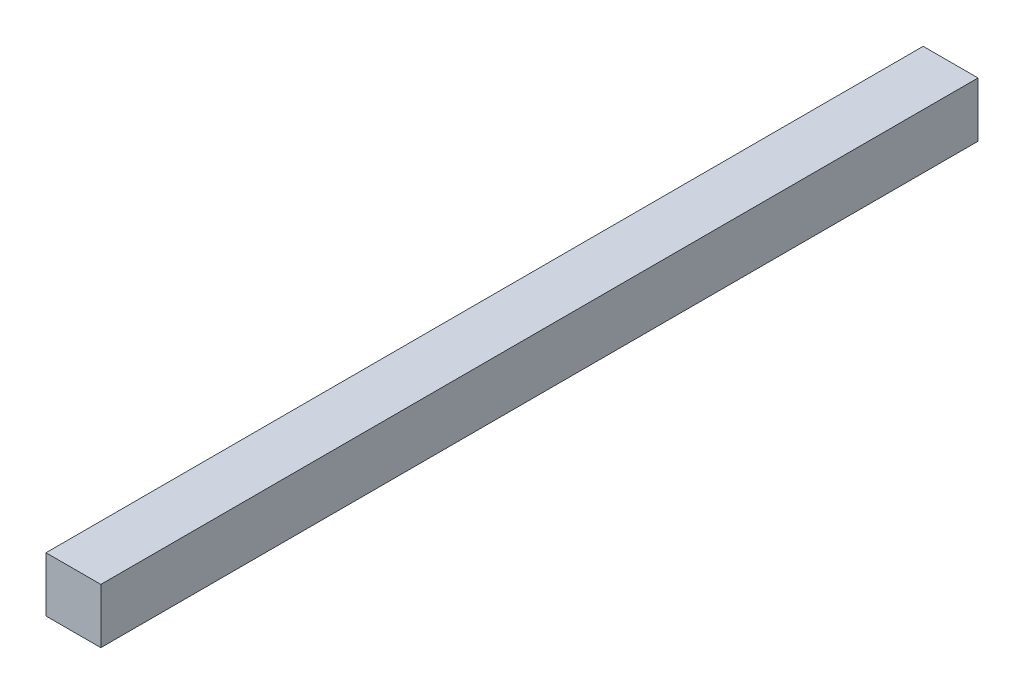
ISO-10303-21;
HEADER;
FILE_DESCRIPTION(('STEP AP214'),'2;1');
FILE_NAME('part.step','',(''),(''),'','','');
FILE_SCHEMA(('AUTOMOTIVE_DESIGN { 1 0 10303 214 1 1 1 1 }'));
ENDSEC;
DATA;
#1=APPLICATION_CONTEXT('core data for automotive mechanical design processes');
#2=APPLICATION_PROTOCOL_DEFINITION('international standard','automotive_design',2000,#1);
#3=PRODUCT_CONTEXT('',#1,'mechanical');
#4=PRODUCT('Part','Part','',(#3));
#5=PRODUCT_RELATED_PRODUCT_CATEGORY('part','',(#4));
#6=PRODUCT_DEFINITION_FORMATION('','',#4);
#7=PRODUCT_DEFINITION_CONTEXT('part definition',#1,'design');
#8=PRODUCT_DEFINITION('design','',#6,#7);
#9=PRODUCT_DEFINITION_SHAPE('','',#8);
#10=(LENGTH_UNIT() NAMED_UNIT(*) SI_UNIT(.MILLI.,.METRE.));
#11=(NAMED_UNIT(*) PLANE_ANGLE_UNIT() SI_UNIT($,.RADIAN.));
#12=(NAMED_UNIT(*) SI_UNIT($,.STERADIAN.) SOLID_ANGLE_UNIT());
#13=UNCERTAINTY_MEASURE_WITH_UNIT(LENGTH_MEASURE(1.E-05),#10,'distance_accuracy_value','');
#14=(GEOMETRIC_REPRESENTATION_CONTEXT(3) GLOBAL_UNCERTAINTY_ASSIGNED_CONTEXT((#13)) GLOBAL_UNIT_ASSIGNED_CONTEXT((#10,
#11,#12)) REPRESENTATION_CONTEXT('',''));
#15=CARTESIAN_POINT('',(0.,0.,0.));
#16=DIRECTION('',(0.,0.,1.));
#17=DIRECTION('',(1.,0.,0.));
#18=AXIS2_PLACEMENT_3D('',#15,#16,#17);
#19=CARTESIAN_POINT('',(0.2499995,-0.2499995,0.));
#20=DIRECTION('',(-1.,0.,0.));
#21=DIRECTION('',(0.,0.,1.));
#22=AXIS2_PLACEMENT_3D('',#19,#20,#21);
#23=PLANE('',#22);
#24=DIRECTION('',(0.,0.,-1.));
#25=VECTOR('',#24,1.);
#26=CARTESIAN_POINT('',(0.2499995,0.2499995,0.));
#27=LINE('',#26,#25);
#28=CARTESIAN_POINT('',(0.2499995,0.2499995,0.));
#29=VERTEX_POINT('',#28);
#30=CARTESIAN_POINT('',(0.2499995,0.2499995,7.99999924));
#31=VERTEX_POINT('',#30);
#32=EDGE_CURVE('E57',#29,#31,#27,.F.);
#33=ORIENTED_EDGE('',*,*,#32,.T.);
#34=DIRECTION('',(0.,1.,0.));
#35=VECTOR('',#34,1.);
#36=CARTESIAN_POINT('',(0.2499995,0.2499995,7.99999924));
#37=LINE('',#36,#35);
#38=CARTESIAN_POINT('',(0.2499995,-0.2499995,7.99999924));
#39=VERTEX_POINT('',#38);
#40=EDGE_CURVE('E54',#31,#39,#37,.F.);
#41=ORIENTED_EDGE('',*,*,#40,.T.);
#42=DIRECTION('',(0.,0.,1.));
#43=VECTOR('',#42,1.);
#44=CARTESIAN_POINT('',(0.2499995,-0.2499995,0.));
#45=LINE('',#44,#43);
#46=CARTESIAN_POINT('',(0.2499995,-0.2499995,0.));
#47=VERTEX_POINT('',#46);
#48=EDGE_CURVE('E76',#39,#47,#45,.F.);
#49=ORIENTED_EDGE('',*,*,#48,.T.);
#50=DIRECTION('',(0.,1.,0.));
#51=VECTOR('',#50,1.);
#52=CARTESIAN_POINT('',(0.2499995,-0.2499995,0.));
#53=LINE('',#52,#51);
#54=EDGE_CURVE('E19',#29,#47,#53,.F.);
#55=ORIENTED_EDGE('',*,*,#54,.F.);
#56=EDGE_LOOP('',(#33,#41,#49,#55));
#57=FACE_BOUND('',#56,.T.);
#58=ADVANCED_FACE('F16',(#57),#23,.F.);
#59=CARTESIAN_POINT('',(0.2499995,0.2499995,0.));
#60=DIRECTION('',(0.,-1.,0.));
#61=DIRECTION('',(0.,0.,-1.));
#62=AXIS2_PLACEMENT_3D('',#59,#60,#61);
#63=PLANE('',#62);
#64=DIRECTION('',(0.,0.,-1.));
#65=VECTOR('',#64,1.);
#66=CARTESIAN_POINT('',(-0.2499995,0.2499995,0.));
#67=LINE('',#66,#65);
#68=CARTESIAN_POINT('',(-0.2499995,0.2499995,0.));
#69=VERTEX_POINT('',#68);
#70=CARTESIAN_POINT('',(-0.2499995,0.2499995,7.99999924));
#71=VERTEX_POINT('',#70);
#72=EDGE_CURVE('E72',#69,#71,#67,.F.);
#73=ORIENTED_EDGE('',*,*,#72,.T.);
#74=DIRECTION('',(-1.,0.,0.));
#75=VECTOR('',#74,1.);
#76=CARTESIAN_POINT('',(-0.2499995,0.2499995,7.99999924));
#77=LINE('',#76,#75);
#78=EDGE_CURVE('E62',#71,#31,#77,.F.);
#79=ORIENTED_EDGE('',*,*,#78,.T.);
#80=ORIENTED_EDGE('',*,*,#32,.F.);
#81=DIRECTION('',(-1.,0.,0.));
#82=VECTOR('',#81,1.);
#83=CARTESIAN_POINT('',(-0.2499995,0.2499995,0.));
#84=LINE('',#83,#82);
#85=EDGE_CURVE('E78',#69,#29,#84,.F.);
#86=ORIENTED_EDGE('',*,*,#85,.F.);
#87=EDGE_LOOP('',(#73,#79,#80,#86));
#88=FACE_BOUND('',#87,.T.);
#89=ADVANCED_FACE('F71',(#88),#63,.F.);
#90=CARTESIAN_POINT('',(-0.2499995,0.2499995,7.99999924));
#91=DIRECTION('',(0.,0.,-1.));
#92=DIRECTION('',(-1.,0.,0.));
#93=AXIS2_PLACEMENT_3D('',#90,#91,#92);
#94=PLANE('',#93);
#95=DIRECTION('',(1.,0.,0.));
#96=VECTOR('',#95,1.);
#97=CARTESIAN_POINT('',(-0.2499995,-0.2499995,7.99999924));
#98=LINE('',#97,#96);
#99=CARTESIAN_POINT('',(-0.2499995,-0.2499995,7.99999924));
#100=VERTEX_POINT('',#99);
#101=EDGE_CURVE('E68',#100,#39,#98,.T.);
#102=ORIENTED_EDGE('',*,*,#101,.T.);
#103=ORIENTED_EDGE('',*,*,#40,.F.);
#104=ORIENTED_EDGE('',*,*,#78,.F.);
#105=DIRECTION('',(0.,1.,0.));
#106=VECTOR('',#105,1.);
#107=CARTESIAN_POINT('',(-0.2499995,0.2499995,7.99999924));
#108=LINE('',#107,#106);
#109=EDGE_CURVE('E82',#71,#100,#108,.F.);
#110=ORIENTED_EDGE('',*,*,#109,.T.);
#111=EDGE_LOOP('',(#102,#103,#104,#110));
#112=FACE_BOUND('',#111,.T.);
#113=ADVANCED_FACE('F65',(#112),#94,.F.);
#114=CARTESIAN_POINT('',(-0.2499995,-0.2499995,0.));
#115=DIRECTION('',(0.,1.,0.));
#116=DIRECTION('',(0.,0.,1.));
#117=AXIS2_PLACEMENT_3D('',#114,#115,#116);
#118=PLANE('',#117);
#119=ORIENTED_EDGE('',*,*,#48,.F.);
#120=ORIENTED_EDGE('',*,*,#101,.F.);
#121=DIRECTION('',(0.,0.,-1.));
#122=VECTOR('',#121,1.);
#123=CARTESIAN_POINT('',(-0.2499995,-0.2499995,0.));
#124=LINE('',#123,#122);
#125=CARTESIAN_POINT('',(-0.2499995,-0.2499995,0.));
#126=VERTEX_POINT('',#125);
#127=EDGE_CURVE('E25',#100,#126,#124,.T.);
#128=ORIENTED_EDGE('',*,*,#127,.T.);
#129=DIRECTION('',(-1.,0.,0.));
#130=VECTOR('',#129,1.);
#131=CARTESIAN_POINT('',(-0.2499995,-0.2499995,0.));
#132=LINE('',#131,#130);
#133=EDGE_CURVE('E33',#47,#126,#132,.T.);
#134=ORIENTED_EDGE('',*,*,#133,.F.);
#135=EDGE_LOOP('',(#119,#120,#128,#134));
#136=FACE_BOUND('',#135,.T.);
#137=ADVANCED_FACE('F87',(#136),#118,.F.);
#138=CARTESIAN_POINT('',(-0.2499995,0.2499995,0.));
#139=DIRECTION('',(0.,0.,-1.));
#140=DIRECTION('',(-1.,0.,0.));
#141=AXIS2_PLACEMENT_3D('',#138,#139,#140);
#142=PLANE('',#141);
#143=ORIENTED_EDGE('',*,*,#133,.T.);
#144=DIRECTION('',(0.,1.,0.));
#145=VECTOR('',#144,1.);
#146=CARTESIAN_POINT('',(-0.2499995,0.2499995,0.));
#147=LINE('',#146,#145);
#148=EDGE_CURVE('E10',#126,#69,#147,.T.);
#149=ORIENTED_EDGE('',*,*,#148,.T.);
#150=ORIENTED_EDGE('',*,*,#85,.T.);
#151=ORIENTED_EDGE('',*,*,#54,.T.);
#152=EDGE_LOOP('',(#143,#149,#150,#151));
#153=FACE_BOUND('',#152,.T.);
#154=ADVANCED_FACE('F90',(#153),#142,.T.);
#155=CARTESIAN_POINT('',(-0.2499995,0.2499995,0.));
#156=DIRECTION('',(1.,0.,0.));
#157=DIRECTION('',(0.,0.,-1.));
#158=AXIS2_PLACEMENT_3D('',#155,#156,#157);
#159=PLANE('',#158);
#160=ORIENTED_EDGE('',*,*,#127,.F.);
#161=ORIENTED_EDGE('',*,*,#109,.F.);
#162=ORIENTED_EDGE('',*,*,#72,.F.);
#163=ORIENTED_EDGE('',*,*,#148,.F.);
#164=EDGE_LOOP('',(#160,#161,#162,#163));
#165=FACE_BOUND('',#164,.T.);
#166=ADVANCED_FACE('F89',(#165),#159,.F.);
#167=CLOSED_SHELL('',(#58,#89,#113,#137,#154,#166));
#168=MANIFOLD_SOLID_BREP('B1',#167);
#169=ADVANCED_BREP_SHAPE_REPRESENTATION('',(#18,#168),#14);
#170=SHAPE_DEFINITION_REPRESENTATION(#9,#169);
ENDSEC;
END-ISO-10303-21;
